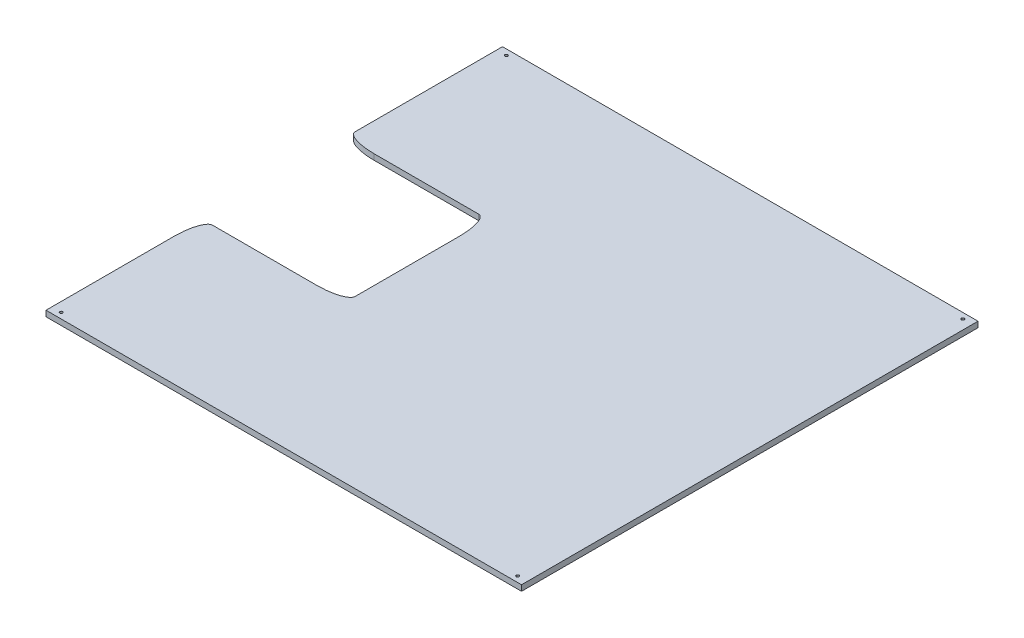
ISO-10303-21;
HEADER;
FILE_DESCRIPTION(('STEP AP214'),'2;1');
FILE_NAME('part.step','',(''),(''),'','','');
FILE_SCHEMA(('AUTOMOTIVE_DESIGN { 1 0 10303 214 1 1 1 1 }'));
ENDSEC;
DATA;
#1=APPLICATION_CONTEXT('core data for automotive mechanical design processes');
#2=APPLICATION_PROTOCOL_DEFINITION('international standard','automotive_design',2000,#1);
#3=PRODUCT_CONTEXT('',#1,'mechanical');
#4=PRODUCT('Part','Part','',(#3));
#5=PRODUCT_RELATED_PRODUCT_CATEGORY('part','',(#4));
#6=PRODUCT_DEFINITION_FORMATION('','',#4);
#7=PRODUCT_DEFINITION_CONTEXT('part definition',#1,'design');
#8=PRODUCT_DEFINITION('design','',#6,#7);
#9=PRODUCT_DEFINITION_SHAPE('','',#8);
#10=(LENGTH_UNIT() NAMED_UNIT(*) SI_UNIT(.MILLI.,.METRE.));
#11=(NAMED_UNIT(*) PLANE_ANGLE_UNIT() SI_UNIT($,.RADIAN.));
#12=(NAMED_UNIT(*) SI_UNIT($,.STERADIAN.) SOLID_ANGLE_UNIT());
#13=UNCERTAINTY_MEASURE_WITH_UNIT(LENGTH_MEASURE(1.E-05),#10,'distance_accuracy_value','');
#14=(GEOMETRIC_REPRESENTATION_CONTEXT(3) GLOBAL_UNCERTAINTY_ASSIGNED_CONTEXT((#13)) GLOBAL_UNIT_ASSIGNED_CONTEXT((#10,
#11,#12)) REPRESENTATION_CONTEXT('',''));
#15=CARTESIAN_POINT('',(0.,0.,0.));
#16=DIRECTION('',(0.,0.,1.));
#17=DIRECTION('',(1.,0.,0.));
#18=AXIS2_PLACEMENT_3D('',#15,#16,#17);
#19=CARTESIAN_POINT('',(0.,6.,165.));
#20=DIRECTION('',(0.,0.,-1.));
#21=DIRECTION('',(-1.,0.,0.));
#22=AXIS2_PLACEMENT_3D('',#19,#20,#21);
#23=PLANE('',#22);
#24=DIRECTION('',(1.,0.,0.));
#25=VECTOR('',#24,1.);
#26=CARTESIAN_POINT('',(0.,0.,165.));
#27=LINE('',#26,#25);
#28=CARTESIAN_POINT('',(30.,0.,165.));
#29=VERTEX_POINT('',#28);
#30=CARTESIAN_POINT('',(140.,0.,165.));
#31=VERTEX_POINT('',#30);
#32=EDGE_CURVE('E184',#29,#31,#27,.T.);
#33=ORIENTED_EDGE('',*,*,#32,.T.);
#34=CARTESIAN_POINT('',(140.,6.3,165.));
#35=CARTESIAN_POINT('',(140.,4.1,165.));
#36=CARTESIAN_POINT('',(140.,1.9,165.));
#37=CARTESIAN_POINT('',(140.,-0.3,165.));
#38=(BOUNDED_CURVE() B_SPLINE_CURVE(3,(#34,#35,#36,#37),.UNSPECIFIED.,.F.,
.F.) B_SPLINE_CURVE_WITH_KNOTS((4,4),(-0.0063,0.0003),
.UNSPECIFIED.) CURVE() GEOMETRIC_REPRESENTATION_ITEM() RATIONAL_B_SPLINE_CURVE((1.,1.,1.,1.)) REPRESENTATION_ITEM(''));
#39=CARTESIAN_POINT('',(140.,6.,165.));
#40=VERTEX_POINT('',#39);
#41=EDGE_CURVE('E321',#31,#40,#38,.F.);
#42=ORIENTED_EDGE('',*,*,#41,.T.);
#43=DIRECTION('',(1.,0.,0.));
#44=VECTOR('',#43,1.);
#45=CARTESIAN_POINT('',(0.,6.,165.));
#46=LINE('',#45,#44);
#47=CARTESIAN_POINT('',(30.,6.,165.));
#48=VERTEX_POINT('',#47);
#49=EDGE_CURVE('E198',#48,#40,#46,.T.);
#50=ORIENTED_EDGE('',*,*,#49,.F.);
#51=CARTESIAN_POINT('',(30.,-0.300000000000001,165.));
#52=CARTESIAN_POINT('',(30.,1.9,165.));
#53=CARTESIAN_POINT('',(30.,4.1,165.));
#54=CARTESIAN_POINT('',(30.,6.3,165.));
#55=(BOUNDED_CURVE() B_SPLINE_CURVE(3,(#51,#52,#53,#54),.UNSPECIFIED.,.F.,
.F.) B_SPLINE_CURVE_WITH_KNOTS((4,4),(-0.0003,0.0063),
.UNSPECIFIED.) CURVE() GEOMETRIC_REPRESENTATION_ITEM() RATIONAL_B_SPLINE_CURVE((1.,1.,1.,1.)) REPRESENTATION_ITEM(''));
#56=EDGE_CURVE('E699',#48,#29,#55,.F.);
#57=ORIENTED_EDGE('',*,*,#56,.T.);
#58=EDGE_LOOP('',(#33,#42,#50,#57));
#59=FACE_BOUND('',#58,.T.);
#60=ADVANCED_FACE('F40',(#59),#23,.F.);
#61=CARTESIAN_POINT('',(150.,6.,0.));
#62=DIRECTION('',(1.,0.,0.));
#63=DIRECTION('',(0.,0.,-1.));
#64=AXIS2_PLACEMENT_3D('',#61,#62,#63);
#65=PLANE('',#64);
#66=DIRECTION('',(0.,0.,1.));
#67=VECTOR('',#66,1.);
#68=CARTESIAN_POINT('',(150.,0.,0.));
#69=LINE('',#68,#67);
#70=CARTESIAN_POINT('',(150.,0.,195.));
#71=VERTEX_POINT('',#70);
#72=CARTESIAN_POINT('',(150.,0.,305.));
#73=VERTEX_POINT('',#72);
#74=EDGE_CURVE('E193',#71,#73,#69,.T.);
#75=ORIENTED_EDGE('',*,*,#74,.T.);
#76=CARTESIAN_POINT('',(150.,6.3,305.));
#77=CARTESIAN_POINT('',(150.,4.1,305.));
#78=CARTESIAN_POINT('',(150.,1.9,305.));
#79=CARTESIAN_POINT('',(150.,-0.300000000000001,305.));
#80=(BOUNDED_CURVE() B_SPLINE_CURVE(3,(#76,#77,#78,#79),.UNSPECIFIED.,.F.,
.F.) B_SPLINE_CURVE_WITH_KNOTS((4,4),(-0.0003,0.0063),
.UNSPECIFIED.) CURVE() GEOMETRIC_REPRESENTATION_ITEM() RATIONAL_B_SPLINE_CURVE((1.,1.,1.,1.)) REPRESENTATION_ITEM(''));
#81=CARTESIAN_POINT('',(150.,6.,305.));
#82=VERTEX_POINT('',#81);
#83=EDGE_CURVE('E436',#73,#82,#80,.F.);
#84=ORIENTED_EDGE('',*,*,#83,.T.);
#85=DIRECTION('',(0.,0.,1.));
#86=VECTOR('',#85,1.);
#87=CARTESIAN_POINT('',(150.,6.,0.));
#88=LINE('',#87,#86);
#89=CARTESIAN_POINT('',(150.,6.,195.));
#90=VERTEX_POINT('',#89);
#91=EDGE_CURVE('E202',#90,#82,#88,.T.);
#92=ORIENTED_EDGE('',*,*,#91,.F.);
#93=CARTESIAN_POINT('',(150.,-0.3,195.));
#94=CARTESIAN_POINT('',(150.,1.9,195.));
#95=CARTESIAN_POINT('',(150.,4.1,195.));
#96=CARTESIAN_POINT('',(150.,6.3,195.));
#97=(BOUNDED_CURVE() B_SPLINE_CURVE(3,(#93,#94,#95,#96),.UNSPECIFIED.,.F.,
.F.) B_SPLINE_CURVE_WITH_KNOTS((4,4),(-0.0063,0.0003),
.UNSPECIFIED.) CURVE() GEOMETRIC_REPRESENTATION_ITEM() RATIONAL_B_SPLINE_CURVE((1.,1.,1.,1.)) REPRESENTATION_ITEM(''));
#98=EDGE_CURVE('E223',#90,#71,#97,.F.);
#99=ORIENTED_EDGE('',*,*,#98,.T.);
#100=EDGE_LOOP('',(#75,#84,#92,#99));
#101=FACE_BOUND('',#100,.T.);
#102=ADVANCED_FACE('F227',(#101),#65,.F.);
#103=CARTESIAN_POINT('',(0.,6.,315.));
#104=DIRECTION('',(0.,0.,-1.));
#105=DIRECTION('',(-1.,0.,0.));
#106=AXIS2_PLACEMENT_3D('',#103,#104,#105);
#107=PLANE('',#106);
#108=DIRECTION('',(1.,0.,0.));
#109=VECTOR('',#108,1.);
#110=CARTESIAN_POINT('',(0.,6.,315.));
#111=LINE('',#110,#109);
#112=CARTESIAN_POINT('',(10.,6.,315.));
#113=VERTEX_POINT('',#112);
#114=CARTESIAN_POINT('',(120.,6.,315.));
#115=VERTEX_POINT('',#114);
#116=EDGE_CURVE('E146',#113,#115,#111,.T.);
#117=ORIENTED_EDGE('',*,*,#116,.T.);
#118=CARTESIAN_POINT('',(120.,-0.300000000000001,315.));
#119=CARTESIAN_POINT('',(120.,1.9,315.));
#120=CARTESIAN_POINT('',(120.,4.1,315.));
#121=CARTESIAN_POINT('',(120.,6.3,315.));
#122=(BOUNDED_CURVE() B_SPLINE_CURVE(3,(#118,#119,#120,#121),.UNSPECIFIED.,.F.,
.F.) B_SPLINE_CURVE_WITH_KNOTS((4,4),(-0.0003,0.0063),
.UNSPECIFIED.) CURVE() GEOMETRIC_REPRESENTATION_ITEM() RATIONAL_B_SPLINE_CURVE((1.,1.,1.,1.)) REPRESENTATION_ITEM(''));
#123=CARTESIAN_POINT('',(120.,0.,315.));
#124=VERTEX_POINT('',#123);
#125=EDGE_CURVE('E301',#115,#124,#122,.F.);
#126=ORIENTED_EDGE('',*,*,#125,.T.);
#127=DIRECTION('',(1.,0.,0.));
#128=VECTOR('',#127,1.);
#129=CARTESIAN_POINT('',(0.,0.,315.));
#130=LINE('',#129,#128);
#131=CARTESIAN_POINT('',(10.,0.,315.));
#132=VERTEX_POINT('',#131);
#133=EDGE_CURVE('E282',#132,#124,#130,.T.);
#134=ORIENTED_EDGE('',*,*,#133,.F.);
#135=CARTESIAN_POINT('',(10.,6.3,315.));
#136=CARTESIAN_POINT('',(10.,4.1,315.));
#137=CARTESIAN_POINT('',(10.,1.9,315.));
#138=CARTESIAN_POINT('',(10.,-0.3,315.));
#139=(BOUNDED_CURVE() B_SPLINE_CURVE(3,(#135,#136,#137,#138),.UNSPECIFIED.,.F.,
.F.) B_SPLINE_CURVE_WITH_KNOTS((4,4),(-0.0063,0.0003),
.UNSPECIFIED.) CURVE() GEOMETRIC_REPRESENTATION_ITEM() RATIONAL_B_SPLINE_CURVE((1.,1.,1.,1.)) REPRESENTATION_ITEM(''));
#140=EDGE_CURVE('E156',#132,#113,#139,.F.);
#141=ORIENTED_EDGE('',*,*,#140,.T.);
#142=EDGE_LOOP('',(#117,#126,#134,#141));
#143=FACE_BOUND('',#142,.T.);
#144=ADVANCED_FACE('F237',(#143),#107,.T.);
#145=CARTESIAN_POINT('',(0.,6.,0.));
#146=DIRECTION('',(1.,0.,0.));
#147=DIRECTION('',(0.,0.,-1.));
#148=AXIS2_PLACEMENT_3D('',#145,#146,#147);
#149=PLANE('',#148);
#150=DIRECTION('',(0.,0.,1.));
#151=VECTOR('',#150,1.);
#152=CARTESIAN_POINT('',(0.,6.,0.));
#153=LINE('',#152,#151);
#154=CARTESIAN_POINT('',(0.,6.,345.));
#155=VERTEX_POINT('',#154);
#156=CARTESIAN_POINT('',(0.,6.,480.));
#157=VERTEX_POINT('',#156);
#158=EDGE_CURVE('E136',#155,#157,#153,.T.);
#159=ORIENTED_EDGE('',*,*,#158,.F.);
#160=CARTESIAN_POINT('',(0.,-0.3,345.));
#161=CARTESIAN_POINT('',(0.,1.9,345.));
#162=CARTESIAN_POINT('',(0.,4.1,345.));
#163=CARTESIAN_POINT('',(0.,6.3,345.));
#164=(BOUNDED_CURVE() B_SPLINE_CURVE(3,(#160,#161,#162,#163),.UNSPECIFIED.,.F.,
.F.) B_SPLINE_CURVE_WITH_KNOTS((4,4),(-0.0063,0.0003),
.UNSPECIFIED.) CURVE() GEOMETRIC_REPRESENTATION_ITEM() RATIONAL_B_SPLINE_CURVE((1.,1.,1.,1.)) REPRESENTATION_ITEM(''));
#165=CARTESIAN_POINT('',(0.,0.,345.));
#166=VERTEX_POINT('',#165);
#167=EDGE_CURVE('E542',#155,#166,#164,.F.);
#168=ORIENTED_EDGE('',*,*,#167,.T.);
#169=DIRECTION('',(0.,0.,1.));
#170=VECTOR('',#169,1.);
#171=CARTESIAN_POINT('',(0.,0.,0.));
#172=LINE('',#171,#170);
#173=CARTESIAN_POINT('',(0.,0.,480.));
#174=VERTEX_POINT('',#173);
#175=EDGE_CURVE('E152',#166,#174,#172,.T.);
#176=ORIENTED_EDGE('',*,*,#175,.T.);
#177=DIRECTION('',(0.,-1.,0.));
#178=VECTOR('',#177,1.);
#179=CARTESIAN_POINT('',(0.,6.,480.));
#180=LINE('',#179,#178);
#181=EDGE_CURVE('E149',#157,#174,#180,.T.);
#182=ORIENTED_EDGE('',*,*,#181,.F.);
#183=EDGE_LOOP('',(#159,#168,#176,#182));
#184=FACE_BOUND('',#183,.T.);
#185=ADVANCED_FACE('F150',(#184),#149,.F.);
#186=CARTESIAN_POINT('',(0.,6.,480.));
#187=DIRECTION('',(0.,0.,-1.));
#188=DIRECTION('',(-1.,0.,0.));
#189=AXIS2_PLACEMENT_3D('',#186,#187,#188);
#190=PLANE('',#189);
#191=DIRECTION('',(1.,0.,0.));
#192=VECTOR('',#191,1.);
#193=CARTESIAN_POINT('',(0.,0.,480.));
#194=LINE('',#193,#192);
#195=CARTESIAN_POINT('',(500.,0.,480.));
#196=VERTEX_POINT('',#195);
#197=EDGE_CURVE('E269',#174,#196,#194,.T.);
#198=ORIENTED_EDGE('',*,*,#197,.T.);
#199=DIRECTION('',(0.,-1.,0.));
#200=VECTOR('',#199,1.);
#201=CARTESIAN_POINT('',(500.,6.,480.));
#202=LINE('',#201,#200);
#203=CARTESIAN_POINT('',(500.,6.,480.));
#204=VERTEX_POINT('',#203);
#205=EDGE_CURVE('E157',#204,#196,#202,.T.);
#206=ORIENTED_EDGE('',*,*,#205,.F.);
#207=DIRECTION('',(1.,0.,0.));
#208=VECTOR('',#207,1.);
#209=CARTESIAN_POINT('',(0.,6.,480.));
#210=LINE('',#209,#208);
#211=EDGE_CURVE('E141',#157,#204,#210,.T.);
#212=ORIENTED_EDGE('',*,*,#211,.F.);
#213=ORIENTED_EDGE('',*,*,#181,.T.);
#214=EDGE_LOOP('',(#198,#206,#212,#213));
#215=FACE_BOUND('',#214,.T.);
#216=ADVANCED_FACE('F159',(#215),#190,.F.);
#217=CARTESIAN_POINT('',(500.,6.,-1.15648231731787E-13));
#218=DIRECTION('',(1.,0.,0.));
#219=DIRECTION('',(0.,0.,-1.));
#220=AXIS2_PLACEMENT_3D('',#217,#218,#219);
#221=PLANE('',#220);
#222=DIRECTION('',(0.,0.,1.));
#223=VECTOR('',#222,1.);
#224=CARTESIAN_POINT('',(500.,0.,-1.15648231731787E-13));
#225=LINE('',#224,#223);
#226=CARTESIAN_POINT('',(500.,0.,0.));
#227=VERTEX_POINT('',#226);
#228=EDGE_CURVE('E272',#227,#196,#225,.T.);
#229=ORIENTED_EDGE('',*,*,#228,.F.);
#230=DIRECTION('',(0.,-1.,0.));
#231=VECTOR('',#230,1.);
#232=CARTESIAN_POINT('',(500.,6.,0.));
#233=LINE('',#232,#231);
#234=CARTESIAN_POINT('',(500.,6.,0.));
#235=VERTEX_POINT('',#234);
#236=EDGE_CURVE('E279',#235,#227,#233,.T.);
#237=ORIENTED_EDGE('',*,*,#236,.F.);
#238=DIRECTION('',(0.,0.,1.));
#239=VECTOR('',#238,1.);
#240=CARTESIAN_POINT('',(500.,6.,-1.15648231731787E-13));
#241=LINE('',#240,#239);
#242=EDGE_CURVE('E161',#235,#204,#241,.T.);
#243=ORIENTED_EDGE('',*,*,#242,.T.);
#244=ORIENTED_EDGE('',*,*,#205,.T.);
#245=EDGE_LOOP('',(#229,#237,#243,#244));
#246=FACE_BOUND('',#245,.T.);
#247=ADVANCED_FACE('F625',(#246),#221,.T.);
#248=CARTESIAN_POINT('',(0.,6.,0.));
#249=DIRECTION('',(0.,0.,-1.));
#250=DIRECTION('',(-1.,0.,0.));
#251=AXIS2_PLACEMENT_3D('',#248,#249,#250);
#252=PLANE('',#251);
#253=DIRECTION('',(1.,0.,0.));
#254=VECTOR('',#253,1.);
#255=CARTESIAN_POINT('',(0.,0.,0.));
#256=LINE('',#255,#254);
#257=CARTESIAN_POINT('',(0.,0.,0.));
#258=VERTEX_POINT('',#257);
#259=EDGE_CURVE('E264',#258,#227,#256,.T.);
#260=ORIENTED_EDGE('',*,*,#259,.F.);
#261=DIRECTION('',(0.,-1.,0.));
#262=VECTOR('',#261,1.);
#263=CARTESIAN_POINT('',(0.,6.,0.));
#264=LINE('',#263,#262);
#265=CARTESIAN_POINT('',(0.,6.,0.));
#266=VERTEX_POINT('',#265);
#267=EDGE_CURVE('E277',#266,#258,#264,.T.);
#268=ORIENTED_EDGE('',*,*,#267,.F.);
#269=DIRECTION('',(1.,0.,0.));
#270=VECTOR('',#269,1.);
#271=CARTESIAN_POINT('',(0.,6.,0.));
#272=LINE('',#271,#270);
#273=EDGE_CURVE('E163',#266,#235,#272,.T.);
#274=ORIENTED_EDGE('',*,*,#273,.T.);
#275=ORIENTED_EDGE('',*,*,#236,.T.);
#276=EDGE_LOOP('',(#260,#268,#274,#275));
#277=FACE_BOUND('',#276,.T.);
#278=ADVANCED_FACE('F618',(#277),#252,.T.);
#279=CARTESIAN_POINT('',(9.99999999999995,6.,6.00000000000001));
#280=DIRECTION('',(0.,-1.,0.));
#281=DIRECTION('',(0.,0.,-1.));
#282=AXIS2_PLACEMENT_3D('',#279,#280,#281);
#283=CYLINDRICAL_SURFACE('',#282,1.5);
#284=CARTESIAN_POINT('',(9.99999999999995,6.,6.00000000000001));
#285=DIRECTION('',(0.,1.,0.));
#286=DIRECTION('',(0.,0.,1.));
#287=AXIS2_PLACEMENT_3D('',#284,#285,#286);
#288=CIRCLE('',#287,1.5);
#289=CARTESIAN_POINT('',(9.99999999999995,6.,7.50000000000001));
#290=VERTEX_POINT('',#289);
#291=EDGE_CURVE('E203',#290,#290,#288,.T.);
#292=ORIENTED_EDGE('',*,*,#291,.T.);
#293=EDGE_LOOP('',(#292));
#294=FACE_BOUND('',#293,.T.);
#295=CARTESIAN_POINT('',(9.99999999999995,0.,6.00000000000001));
#296=DIRECTION('',(0.,1.,0.));
#297=DIRECTION('',(0.,0.,1.));
#298=AXIS2_PLACEMENT_3D('',#295,#296,#297);
#299=CIRCLE('',#298,1.5);
#300=CARTESIAN_POINT('',(9.99999999999995,0.,7.50000000000001));
#301=VERTEX_POINT('',#300);
#302=EDGE_CURVE('E181',#301,#301,#299,.T.);
#303=ORIENTED_EDGE('',*,*,#302,.F.);
#304=EDGE_LOOP('',(#303));
#305=FACE_BOUND('',#304,.T.);
#306=ADVANCED_FACE('F245',(#294,#305),#283,.F.);
#307=CARTESIAN_POINT('',(490.,6.,6.00000000000001));
#308=DIRECTION('',(0.,-1.,0.));
#309=DIRECTION('',(0.,0.,-1.));
#310=AXIS2_PLACEMENT_3D('',#307,#308,#309);
#311=CYLINDRICAL_SURFACE('',#310,1.50000000000008);
#312=CARTESIAN_POINT('',(490.,6.,6.00000000000001));
#313=DIRECTION('',(0.,1.,0.));
#314=DIRECTION('',(0.,0.,1.));
#315=AXIS2_PLACEMENT_3D('',#312,#313,#314);
#316=CIRCLE('',#315,1.50000000000008);
#317=CARTESIAN_POINT('',(490.,6.,7.50000000000009));
#318=VERTEX_POINT('',#317);
#319=EDGE_CURVE('E738',#318,#318,#316,.T.);
#320=ORIENTED_EDGE('',*,*,#319,.T.);
#321=EDGE_LOOP('',(#320));
#322=FACE_BOUND('',#321,.T.);
#323=CARTESIAN_POINT('',(490.,0.,6.00000000000001));
#324=DIRECTION('',(0.,1.,0.));
#325=DIRECTION('',(0.,0.,1.));
#326=AXIS2_PLACEMENT_3D('',#323,#324,#325);
#327=CIRCLE('',#326,1.50000000000008);
#328=CARTESIAN_POINT('',(490.,0.,7.50000000000009));
#329=VERTEX_POINT('',#328);
#330=EDGE_CURVE('E178',#329,#329,#327,.T.);
#331=ORIENTED_EDGE('',*,*,#330,.F.);
#332=EDGE_LOOP('',(#331));
#333=FACE_BOUND('',#332,.T.);
#334=ADVANCED_FACE('F605',(#322,#333),#311,.F.);
#335=CARTESIAN_POINT('',(10.0000000000001,6.,474.));
#336=DIRECTION('',(0.,-1.,0.));
#337=DIRECTION('',(0.,0.,-1.));
#338=AXIS2_PLACEMENT_3D('',#335,#336,#337);
#339=CYLINDRICAL_SURFACE('',#338,1.52499999999999);
#340=CARTESIAN_POINT('',(10.0000000000001,6.,474.));
#341=DIRECTION('',(0.,1.,0.));
#342=DIRECTION('',(0.,0.,1.));
#343=AXIS2_PLACEMENT_3D('',#340,#341,#342);
#344=CIRCLE('',#343,1.52499999999999);
#345=CARTESIAN_POINT('',(10.0000000000001,6.,475.525));
#346=VERTEX_POINT('',#345);
#347=EDGE_CURVE('E740',#346,#346,#344,.T.);
#348=ORIENTED_EDGE('',*,*,#347,.T.);
#349=EDGE_LOOP('',(#348));
#350=FACE_BOUND('',#349,.T.);
#351=CARTESIAN_POINT('',(10.0000000000001,0.,474.));
#352=DIRECTION('',(0.,1.,0.));
#353=DIRECTION('',(0.,0.,1.));
#354=AXIS2_PLACEMENT_3D('',#351,#352,#353);
#355=CIRCLE('',#354,1.52499999999999);
#356=CARTESIAN_POINT('',(10.0000000000001,0.,475.525));
#357=VERTEX_POINT('',#356);
#358=EDGE_CURVE('E175',#357,#357,#355,.T.);
#359=ORIENTED_EDGE('',*,*,#358,.F.);
#360=EDGE_LOOP('',(#359));
#361=FACE_BOUND('',#360,.T.);
#362=ADVANCED_FACE('F597',(#350,#361),#339,.F.);
#363=CARTESIAN_POINT('',(490.,6.,474.));
#364=DIRECTION('',(0.,-1.,0.));
#365=DIRECTION('',(0.,0.,-1.));
#366=AXIS2_PLACEMENT_3D('',#363,#364,#365);
#367=CYLINDRICAL_SURFACE('',#366,1.50000000000002);
#368=CARTESIAN_POINT('',(490.,6.,474.));
#369=DIRECTION('',(0.,1.,0.));
#370=DIRECTION('',(0.,0.,1.));
#371=AXIS2_PLACEMENT_3D('',#368,#369,#370);
#372=CIRCLE('',#371,1.50000000000002);
#373=CARTESIAN_POINT('',(490.,6.,475.5));
#374=VERTEX_POINT('',#373);
#375=EDGE_CURVE('E263',#374,#374,#372,.T.);
#376=ORIENTED_EDGE('',*,*,#375,.T.);
#377=EDGE_LOOP('',(#376));
#378=FACE_BOUND('',#377,.T.);
#379=CARTESIAN_POINT('',(490.,0.,474.));
#380=DIRECTION('',(0.,1.,0.));
#381=DIRECTION('',(0.,0.,1.));
#382=AXIS2_PLACEMENT_3D('',#379,#380,#381);
#383=CIRCLE('',#382,1.50000000000002);
#384=CARTESIAN_POINT('',(490.,0.,475.5));
#385=VERTEX_POINT('',#384);
#386=EDGE_CURVE('E172',#385,#385,#383,.T.);
#387=ORIENTED_EDGE('',*,*,#386,.F.);
#388=EDGE_LOOP('',(#387));
#389=FACE_BOUND('',#388,.T.);
#390=ADVANCED_FACE('F410',(#378,#389),#367,.F.);
#391=CARTESIAN_POINT('',(0.,0.,155.));
#392=VERTEX_POINT('',#391);
#393=EDGE_CURVE('E255',#258,#392,#172,.T.);
#394=ORIENTED_EDGE('',*,*,#393,.T.);
#395=CARTESIAN_POINT('',(0.,6.3,155.));
#396=CARTESIAN_POINT('',(0.,4.1,155.));
#397=CARTESIAN_POINT('',(0.,1.9,155.));
#398=CARTESIAN_POINT('',(0.,-0.300000000000001,155.));
#399=(BOUNDED_CURVE() B_SPLINE_CURVE(3,(#395,#396,#397,#398),.UNSPECIFIED.,.F.,
.F.) B_SPLINE_CURVE_WITH_KNOTS((4,4),(-0.0003,0.0063),
.UNSPECIFIED.) CURVE() GEOMETRIC_REPRESENTATION_ITEM() RATIONAL_B_SPLINE_CURVE((1.,1.,1.,1.)) REPRESENTATION_ITEM(''));
#400=CARTESIAN_POINT('',(0.,6.,155.));
#401=VERTEX_POINT('',#400);
#402=EDGE_CURVE('E70',#392,#401,#399,.F.);
#403=ORIENTED_EDGE('',*,*,#402,.T.);
#404=EDGE_CURVE('E171',#266,#401,#153,.T.);
#405=ORIENTED_EDGE('',*,*,#404,.F.);
#406=ORIENTED_EDGE('',*,*,#267,.T.);
#407=EDGE_LOOP('',(#394,#403,#405,#406));
#408=FACE_BOUND('',#407,.T.);
#409=ADVANCED_FACE('F340',(#408),#149,.F.);
#410=CARTESIAN_POINT('',(0.,6.,0.));
#411=DIRECTION('',(0.,1.,0.));
#412=DIRECTION('',(0.,0.,1.));
#413=AXIS2_PLACEMENT_3D('',#410,#411,#412);
#414=PLANE('',#413);
#415=ORIENTED_EDGE('',*,*,#375,.F.);
#416=EDGE_LOOP('',(#415));
#417=FACE_BOUND('',#416,.T.);
#418=ORIENTED_EDGE('',*,*,#347,.F.);
#419=EDGE_LOOP('',(#418));
#420=FACE_BOUND('',#419,.T.);
#421=ORIENTED_EDGE('',*,*,#319,.F.);
#422=EDGE_LOOP('',(#421));
#423=FACE_BOUND('',#422,.T.);
#424=ORIENTED_EDGE('',*,*,#291,.F.);
#425=EDGE_LOOP('',(#424));
#426=FACE_BOUND('',#425,.T.);
#427=ORIENTED_EDGE('',*,*,#404,.T.);
#428=CARTESIAN_POINT('',(30.,6.,165.));
#429=CARTESIAN_POINT('',(0.,6.,165.));
#430=CARTESIAN_POINT('',(0.,6.,155.));
#431=(BOUNDED_CURVE() B_SPLINE_CURVE(2,(#428,#429,#430),.UNSPECIFIED.,.F.,
.F.) B_SPLINE_CURVE_WITH_KNOTS((3,3),(0.,1.),
.UNSPECIFIED.) CURVE() GEOMETRIC_REPRESENTATION_ITEM() RATIONAL_B_SPLINE_CURVE((1.,
0.707106781186548,1.)) REPRESENTATION_ITEM(''));
#432=EDGE_CURVE('E696',#401,#48,#431,.F.);
#433=ORIENTED_EDGE('',*,*,#432,.T.);
#434=ORIENTED_EDGE('',*,*,#49,.T.);
#435=CARTESIAN_POINT('',(150.,6.,195.));
#436=CARTESIAN_POINT('',(150.,6.,165.));
#437=CARTESIAN_POINT('',(140.,6.,165.));
#438=(BOUNDED_CURVE() B_SPLINE_CURVE(2,(#435,#436,#437),.UNSPECIFIED.,.F.,
.F.) B_SPLINE_CURVE_WITH_KNOTS((3,3),(0.,1.),
.UNSPECIFIED.) CURVE() GEOMETRIC_REPRESENTATION_ITEM() RATIONAL_B_SPLINE_CURVE((1.,
0.707106781186547,1.)) REPRESENTATION_ITEM(''));
#439=EDGE_CURVE('E12',#40,#90,#438,.F.);
#440=ORIENTED_EDGE('',*,*,#439,.T.);
#441=ORIENTED_EDGE('',*,*,#91,.T.);
#442=CARTESIAN_POINT('',(120.,6.,315.));
#443=CARTESIAN_POINT('',(150.,6.,315.));
#444=CARTESIAN_POINT('',(150.,6.,305.));
#445=(BOUNDED_CURVE() B_SPLINE_CURVE(2,(#442,#443,#444),.UNSPECIFIED.,.F.,
.F.) B_SPLINE_CURVE_WITH_KNOTS((3,3),(0.,1.),
.UNSPECIFIED.) CURVE() GEOMETRIC_REPRESENTATION_ITEM() RATIONAL_B_SPLINE_CURVE((1.,
0.707106781186548,1.)) REPRESENTATION_ITEM(''));
#446=EDGE_CURVE('E361',#82,#115,#445,.F.);
#447=ORIENTED_EDGE('',*,*,#446,.T.);
#448=ORIENTED_EDGE('',*,*,#116,.F.);
#449=CARTESIAN_POINT('',(0.,6.,345.));
#450=CARTESIAN_POINT('',(0.,6.,315.));
#451=CARTESIAN_POINT('',(10.,6.,315.));
#452=(BOUNDED_CURVE() B_SPLINE_CURVE(2,(#449,#450,#451),.UNSPECIFIED.,.F.,
.F.) B_SPLINE_CURVE_WITH_KNOTS((3,3),(0.,1.),
.UNSPECIFIED.) CURVE() GEOMETRIC_REPRESENTATION_ITEM() RATIONAL_B_SPLINE_CURVE((1.,
0.707106781186548,1.)) REPRESENTATION_ITEM(''));
#453=EDGE_CURVE('E61',#113,#155,#452,.F.);
#454=ORIENTED_EDGE('',*,*,#453,.T.);
#455=ORIENTED_EDGE('',*,*,#158,.T.);
#456=ORIENTED_EDGE('',*,*,#211,.T.);
#457=ORIENTED_EDGE('',*,*,#242,.F.);
#458=ORIENTED_EDGE('',*,*,#273,.F.);
#459=EDGE_LOOP('',(#427,#433,#434,#440,#441,#447,#448,#454,#455,#456,#457,#458));
#460=FACE_BOUND('',#459,.T.);
#461=ADVANCED_FACE('F138',(#417,#420,#423,#426,#460),#414,.T.);
#462=CARTESIAN_POINT('',(0.,0.,0.));
#463=DIRECTION('',(0.,1.,0.));
#464=DIRECTION('',(0.,0.,1.));
#465=AXIS2_PLACEMENT_3D('',#462,#463,#464);
#466=PLANE('',#465);
#467=ORIENTED_EDGE('',*,*,#386,.T.);
#468=EDGE_LOOP('',(#467));
#469=FACE_BOUND('',#468,.T.);
#470=ORIENTED_EDGE('',*,*,#358,.T.);
#471=EDGE_LOOP('',(#470));
#472=FACE_BOUND('',#471,.T.);
#473=ORIENTED_EDGE('',*,*,#330,.T.);
#474=EDGE_LOOP('',(#473));
#475=FACE_BOUND('',#474,.T.);
#476=ORIENTED_EDGE('',*,*,#302,.T.);
#477=EDGE_LOOP('',(#476));
#478=FACE_BOUND('',#477,.T.);
#479=ORIENTED_EDGE('',*,*,#32,.F.);
#480=CARTESIAN_POINT('',(0.,0.,155.));
#481=CARTESIAN_POINT('',(0.,0.,165.));
#482=CARTESIAN_POINT('',(30.,0.,165.));
#483=(BOUNDED_CURVE() B_SPLINE_CURVE(2,(#480,#481,#482),.UNSPECIFIED.,.F.,
.F.) B_SPLINE_CURVE_WITH_KNOTS((3,3),(0.,1.),
.UNSPECIFIED.) CURVE() GEOMETRIC_REPRESENTATION_ITEM() RATIONAL_B_SPLINE_CURVE((1.,
0.707106781186548,1.)) REPRESENTATION_ITEM(''));
#484=EDGE_CURVE('E320',#29,#392,#483,.F.);
#485=ORIENTED_EDGE('',*,*,#484,.T.);
#486=ORIENTED_EDGE('',*,*,#393,.F.);
#487=ORIENTED_EDGE('',*,*,#259,.T.);
#488=ORIENTED_EDGE('',*,*,#228,.T.);
#489=ORIENTED_EDGE('',*,*,#197,.F.);
#490=ORIENTED_EDGE('',*,*,#175,.F.);
#491=CARTESIAN_POINT('',(10.,0.,315.));
#492=CARTESIAN_POINT('',(0.,0.,315.));
#493=CARTESIAN_POINT('',(0.,0.,345.));
#494=(BOUNDED_CURVE() B_SPLINE_CURVE(2,(#491,#492,#493),.UNSPECIFIED.,.F.,
.F.) B_SPLINE_CURVE_WITH_KNOTS((3,3),(0.,1.),
.UNSPECIFIED.) CURVE() GEOMETRIC_REPRESENTATION_ITEM() RATIONAL_B_SPLINE_CURVE((1.,
0.707106781186548,1.)) REPRESENTATION_ITEM(''));
#495=EDGE_CURVE('E317',#166,#132,#494,.F.);
#496=ORIENTED_EDGE('',*,*,#495,.T.);
#497=ORIENTED_EDGE('',*,*,#133,.T.);
#498=CARTESIAN_POINT('',(150.,0.,305.));
#499=CARTESIAN_POINT('',(150.,0.,315.));
#500=CARTESIAN_POINT('',(120.,0.,315.));
#501=(BOUNDED_CURVE() B_SPLINE_CURVE(2,(#498,#499,#500),.UNSPECIFIED.,.F.,
.F.) B_SPLINE_CURVE_WITH_KNOTS((3,3),(0.,1.),
.UNSPECIFIED.) CURVE() GEOMETRIC_REPRESENTATION_ITEM() RATIONAL_B_SPLINE_CURVE((1.,
0.707106781186548,1.)) REPRESENTATION_ITEM(''));
#502=EDGE_CURVE('E315',#124,#73,#501,.F.);
#503=ORIENTED_EDGE('',*,*,#502,.T.);
#504=ORIENTED_EDGE('',*,*,#74,.F.);
#505=CARTESIAN_POINT('',(140.,0.,165.));
#506=CARTESIAN_POINT('',(150.,0.,165.));
#507=CARTESIAN_POINT('',(150.,0.,195.));
#508=(BOUNDED_CURVE() B_SPLINE_CURVE(2,(#505,#506,#507),.UNSPECIFIED.,.F.,
.F.) B_SPLINE_CURVE_WITH_KNOTS((3,3),(0.,1.),
.UNSPECIFIED.) CURVE() GEOMETRIC_REPRESENTATION_ITEM() RATIONAL_B_SPLINE_CURVE((1.,
0.707106781186547,1.)) REPRESENTATION_ITEM(''));
#509=EDGE_CURVE('E54',#71,#31,#508,.F.);
#510=ORIENTED_EDGE('',*,*,#509,.T.);
#511=EDGE_LOOP('',(#479,#485,#486,#487,#488,#489,#490,#496,#497,#503,#504,#510));
#512=FACE_BOUND('',#511,.T.);
#513=ADVANCED_FACE('F314',(#469,#472,#475,#478,#512),#466,.F.);
#514=CARTESIAN_POINT('',(120.,6.3,315.));
#515=CARTESIAN_POINT('',(120.,4.1,315.));
#516=CARTESIAN_POINT('',(120.,1.9,315.));
#517=CARTESIAN_POINT('',(120.,-0.300000000000001,315.));
#518=CARTESIAN_POINT('',(150.,6.3,315.));
#519=CARTESIAN_POINT('',(150.,4.1,315.));
#520=CARTESIAN_POINT('',(150.,1.9,315.));
#521=CARTESIAN_POINT('',(150.,-0.300000000000001,315.));
#522=CARTESIAN_POINT('',(150.,6.3,305.));
#523=CARTESIAN_POINT('',(150.,4.1,305.));
#524=CARTESIAN_POINT('',(150.,1.9,305.));
#525=CARTESIAN_POINT('',(150.,-0.300000000000001,305.));
#526=(BOUNDED_SURFACE() B_SPLINE_SURFACE(2,3,((#514,#515,#516,#517),(#518,#519,#520,#521),(#522,
#523,#524,#525)),.UNSPECIFIED.,.F.,.F.,.F.) B_SPLINE_SURFACE_WITH_KNOTS((3,3),(4,4),(0.,1.),
(-0.0003,0.0063),.UNSPECIFIED.) GEOMETRIC_REPRESENTATION_ITEM() RATIONAL_B_SPLINE_SURFACE(((1.,
1.,1.,1.),(0.707106781186548,0.707106781186548,0.707106781186548,0.707106781186548),(1.,1.,1.,1.))) REPRESENTATION_ITEM('') SURFACE());
#527=ORIENTED_EDGE('',*,*,#446,.F.);
#528=ORIENTED_EDGE('',*,*,#83,.F.);
#529=ORIENTED_EDGE('',*,*,#502,.F.);
#530=ORIENTED_EDGE('',*,*,#125,.F.);
#531=EDGE_LOOP('',(#527,#528,#529,#530));
#532=FACE_BOUND('',#531,.T.);
#533=ADVANCED_FACE('F337',(#532),#526,.T.);
#534=CARTESIAN_POINT('',(140.,-0.3,165.));
#535=CARTESIAN_POINT('',(140.,1.9,165.));
#536=CARTESIAN_POINT('',(140.,4.1,165.));
#537=CARTESIAN_POINT('',(140.,6.3,165.));
#538=CARTESIAN_POINT('',(150.,-0.3,165.));
#539=CARTESIAN_POINT('',(150.,1.9,165.));
#540=CARTESIAN_POINT('',(150.,4.1,165.));
#541=CARTESIAN_POINT('',(150.,6.3,165.));
#542=CARTESIAN_POINT('',(150.,-0.3,195.));
#543=CARTESIAN_POINT('',(150.,1.9,195.));
#544=CARTESIAN_POINT('',(150.,4.1,195.));
#545=CARTESIAN_POINT('',(150.,6.3,195.));
#546=(BOUNDED_SURFACE() B_SPLINE_SURFACE(2,3,((#534,#535,#536,#537),(#538,#539,#540,#541),(#542,
#543,#544,#545)),.UNSPECIFIED.,.F.,.F.,.F.) B_SPLINE_SURFACE_WITH_KNOTS((3,3),(4,4),(0.,1.),
(-0.0063,0.0003),.UNSPECIFIED.) GEOMETRIC_REPRESENTATION_ITEM() RATIONAL_B_SPLINE_SURFACE(((1.,
1.,1.,1.),(0.707106781186547,0.707106781186547,0.707106781186547,0.707106781186547),(1.,1.,1.,1.))) REPRESENTATION_ITEM('') SURFACE());
#547=ORIENTED_EDGE('',*,*,#439,.F.);
#548=ORIENTED_EDGE('',*,*,#41,.F.);
#549=ORIENTED_EDGE('',*,*,#509,.F.);
#550=ORIENTED_EDGE('',*,*,#98,.F.);
#551=EDGE_LOOP('',(#547,#548,#549,#550));
#552=FACE_BOUND('',#551,.T.);
#553=ADVANCED_FACE('F409',(#552),#546,.T.);
#554=CARTESIAN_POINT('',(30.,6.3,165.));
#555=CARTESIAN_POINT('',(30.,4.1,165.));
#556=CARTESIAN_POINT('',(30.,1.9,165.));
#557=CARTESIAN_POINT('',(30.,-0.300000000000001,165.));
#558=CARTESIAN_POINT('',(0.,6.3,165.));
#559=CARTESIAN_POINT('',(0.,4.1,165.));
#560=CARTESIAN_POINT('',(0.,1.9,165.));
#561=CARTESIAN_POINT('',(0.,-0.300000000000001,165.));
#562=CARTESIAN_POINT('',(0.,6.3,155.));
#563=CARTESIAN_POINT('',(0.,4.1,155.));
#564=CARTESIAN_POINT('',(0.,1.9,155.));
#565=CARTESIAN_POINT('',(0.,-0.300000000000001,155.));
#566=(BOUNDED_SURFACE() B_SPLINE_SURFACE(2,3,((#554,#555,#556,#557),(#558,#559,#560,#561),(#562,
#563,#564,#565)),.UNSPECIFIED.,.F.,.F.,.F.) B_SPLINE_SURFACE_WITH_KNOTS((3,3),(4,4),(0.,1.),
(-0.0003,0.0063),.UNSPECIFIED.) GEOMETRIC_REPRESENTATION_ITEM() RATIONAL_B_SPLINE_SURFACE(((1.,
1.,1.,1.),(0.707106781186548,0.707106781186548,0.707106781186548,0.707106781186548),(1.,1.,1.,1.))) REPRESENTATION_ITEM('') SURFACE());
#567=ORIENTED_EDGE('',*,*,#432,.F.);
#568=ORIENTED_EDGE('',*,*,#402,.F.);
#569=ORIENTED_EDGE('',*,*,#484,.F.);
#570=ORIENTED_EDGE('',*,*,#56,.F.);
#571=EDGE_LOOP('',(#567,#568,#569,#570));
#572=FACE_BOUND('',#571,.T.);
#573=ADVANCED_FACE('F491',(#572),#566,.T.);
#574=CARTESIAN_POINT('',(10.,-0.3,315.));
#575=CARTESIAN_POINT('',(10.,1.9,315.));
#576=CARTESIAN_POINT('',(10.,4.1,315.));
#577=CARTESIAN_POINT('',(10.,6.3,315.));
#578=CARTESIAN_POINT('',(0.,-0.3,315.));
#579=CARTESIAN_POINT('',(0.,1.9,315.));
#580=CARTESIAN_POINT('',(0.,4.1,315.));
#581=CARTESIAN_POINT('',(0.,6.3,315.));
#582=CARTESIAN_POINT('',(0.,-0.3,345.));
#583=CARTESIAN_POINT('',(0.,1.9,345.));
#584=CARTESIAN_POINT('',(0.,4.1,345.));
#585=CARTESIAN_POINT('',(0.,6.3,345.));
#586=(BOUNDED_SURFACE() B_SPLINE_SURFACE(2,3,((#574,#575,#576,#577),(#578,#579,#580,#581),(#582,
#583,#584,#585)),.UNSPECIFIED.,.F.,.F.,.F.) B_SPLINE_SURFACE_WITH_KNOTS((3,3),(4,4),(0.,1.),
(-0.0063,0.0003),.UNSPECIFIED.) GEOMETRIC_REPRESENTATION_ITEM() RATIONAL_B_SPLINE_SURFACE(((1.,
1.,1.,1.),(0.707106781186548,0.707106781186548,0.707106781186548,0.707106781186548),(1.,1.,1.,1.))) REPRESENTATION_ITEM('') SURFACE());
#587=ORIENTED_EDGE('',*,*,#453,.F.);
#588=ORIENTED_EDGE('',*,*,#140,.F.);
#589=ORIENTED_EDGE('',*,*,#495,.F.);
#590=ORIENTED_EDGE('',*,*,#167,.F.);
#591=EDGE_LOOP('',(#587,#588,#589,#590));
#592=FACE_BOUND('',#591,.T.);
#593=ADVANCED_FACE('F43',(#592),#586,.T.);
#594=CLOSED_SHELL('',(#60,#102,#144,#185,#216,#247,#278,#306,#334,#362,#390,#409,#461,#513,#533,
#553,#573,#593));
#595=MANIFOLD_SOLID_BREP('B2',#594);
#596=ADVANCED_BREP_SHAPE_REPRESENTATION('',(#18,#595),#14);
#597=SHAPE_DEFINITION_REPRESENTATION(#9,#596);
ENDSEC;
END-ISO-10303-21;
